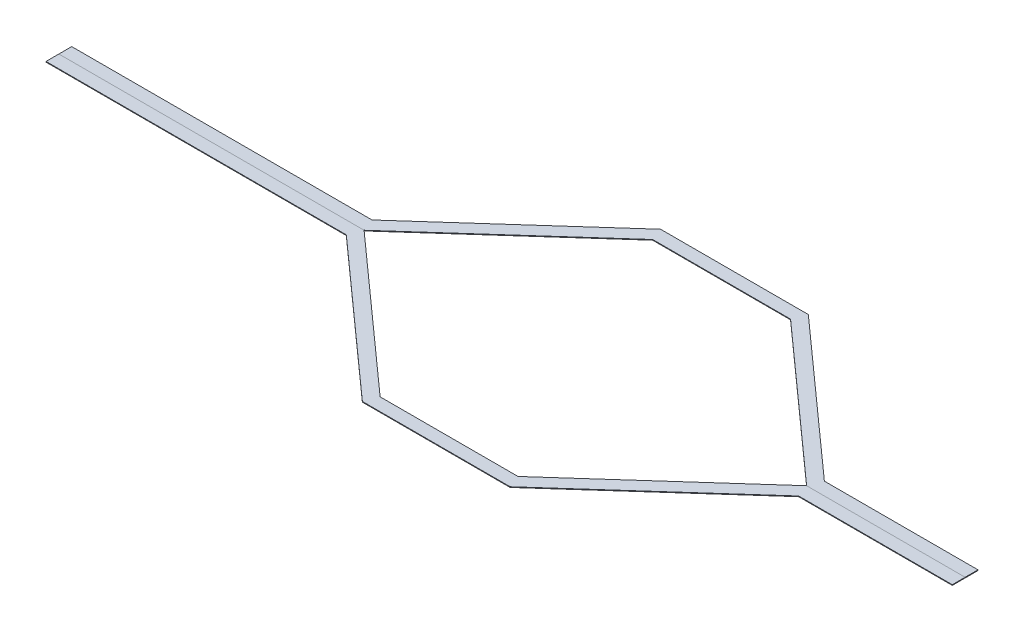
ISO-10303-21;
HEADER;
FILE_DESCRIPTION(('STEP AP214'),'2;1');
FILE_NAME('part.step','',(''),(''),'','','');
FILE_SCHEMA(('AUTOMOTIVE_DESIGN { 1 0 10303 214 1 1 1 1 }'));
ENDSEC;
DATA;
#1=APPLICATION_CONTEXT('core data for automotive mechanical design processes');
#2=APPLICATION_PROTOCOL_DEFINITION('international standard','automotive_design',2000,#1);
#3=PRODUCT_CONTEXT('',#1,'mechanical');
#4=PRODUCT('Part','Part','',(#3));
#5=PRODUCT_RELATED_PRODUCT_CATEGORY('part','',(#4));
#6=PRODUCT_DEFINITION_FORMATION('','',#4);
#7=PRODUCT_DEFINITION_CONTEXT('part definition',#1,'design');
#8=PRODUCT_DEFINITION('design','',#6,#7);
#9=PRODUCT_DEFINITION_SHAPE('','',#8);
#10=(LENGTH_UNIT() NAMED_UNIT(*) SI_UNIT(.MILLI.,.METRE.));
#11=(NAMED_UNIT(*) PLANE_ANGLE_UNIT() SI_UNIT($,.RADIAN.));
#12=(NAMED_UNIT(*) SI_UNIT($,.STERADIAN.) SOLID_ANGLE_UNIT());
#13=UNCERTAINTY_MEASURE_WITH_UNIT(LENGTH_MEASURE(1.E-05),#10,'distance_accuracy_value','');
#14=(GEOMETRIC_REPRESENTATION_CONTEXT(3) GLOBAL_UNCERTAINTY_ASSIGNED_CONTEXT((#13)) GLOBAL_UNIT_ASSIGNED_CONTEXT((#10,
#11,#12)) REPRESENTATION_CONTEXT('',''));
#15=CARTESIAN_POINT('',(0.,0.,0.));
#16=DIRECTION('',(0.,0.,1.));
#17=DIRECTION('',(1.,0.,0.));
#18=AXIS2_PLACEMENT_3D('',#15,#16,#17);
#19=CARTESIAN_POINT('',(0.,2.54,0.));
#20=DIRECTION('',(0.,1.,0.));
#21=DIRECTION('',(0.,0.,1.));
#22=AXIS2_PLACEMENT_3D('',#19,#20,#21);
#23=PLANE('',#22);
#24=DIRECTION('',(-1.,0.,0.));
#25=VECTOR('',#24,1.);
#26=CARTESIAN_POINT('',(0.,2.54,0.));
#27=LINE('',#26,#25);
#28=CARTESIAN_POINT('',(1748.8414211344,2.54,0.));
#29=VERTEX_POINT('',#28);
#30=CARTESIAN_POINT('',(2375.3067105672,2.54,0.));
#31=VERTEX_POINT('',#30);
#32=EDGE_CURVE('P0_E162',#29,#31,#27,.F.);
#33=ORIENTED_EDGE('',*,*,#32,.T.);
#34=DIRECTION('',(0.,0.,-1.));
#35=VECTOR('',#34,1.);
#36=CARTESIAN_POINT('',(2375.3067105672,2.54,0.));
#37=LINE('',#36,#35);
#38=CARTESIAN_POINT('',(2375.3067105672,2.54,-50.8));
#39=VERTEX_POINT('',#38);
#40=EDGE_CURVE('P0_E164',#39,#31,#37,.F.);
#41=ORIENTED_EDGE('',*,*,#40,.F.);
#42=DIRECTION('',(-1.,0.,0.));
#43=VECTOR('',#42,1.);
#44=CARTESIAN_POINT('',(0.,2.54,-50.8));
#45=LINE('',#44,#43);
#46=CARTESIAN_POINT('',(1768.2467105672,2.54,-50.8000000000003));
#47=VERTEX_POINT('',#46);
#48=EDGE_CURVE('P0_E119',#47,#39,#45,.F.);
#49=ORIENTED_EDGE('',*,*,#48,.F.);
#50=DIRECTION('',(-0.745323557128352,0.,-0.666702928739285));
#51=VECTOR('',#50,1.);
#52=CARTESIAN_POINT('',(811.215920403235,2.54,-906.878175167768));
#53=LINE('',#52,#51);
#54=CARTESIAN_POINT('',(1166.2667105672,2.54,-589.28));
#55=VERTEX_POINT('',#54);
#56=EDGE_CURVE('P0_E20',#55,#47,#53,.F.);
#57=ORIENTED_EDGE('',*,*,#56,.F.);
#58=DIRECTION('',(-1.,0.,0.));
#59=VECTOR('',#58,1.);
#60=CARTESIAN_POINT('',(0.,2.54,-589.28));
#61=LINE('',#60,#59);
#62=CARTESIAN_POINT('',(582.574710567202,2.54,-589.28));
#63=VERTEX_POINT('',#62);
#64=EDGE_CURVE('P0_E107',#63,#55,#61,.F.);
#65=ORIENTED_EDGE('',*,*,#64,.F.);
#66=DIRECTION('',(-0.745323557128352,0.,0.666702928739285));
#67=VECTOR('',#66,1.);
#68=CARTESIAN_POINT('',(-33.8685087799557,2.54,-37.8624367021203));
#69=LINE('',#68,#67);
#70=CARTESIAN_POINT('',(-19.4052894327977,2.54,-50.8));
#71=VERTEX_POINT('',#70);
#72=EDGE_CURVE('P0_E102',#71,#63,#69,.F.);
#73=ORIENTED_EDGE('',*,*,#72,.F.);
#74=DIRECTION('',(-1.,0.,0.));
#75=VECTOR('',#74,1.);
#76=CARTESIAN_POINT('',(0.,2.54,-50.8));
#77=LINE('',#76,#75);
#78=CARTESIAN_POINT('',(-1206.0932894328,2.54,-50.8));
#79=VERTEX_POINT('',#78);
#80=EDGE_CURVE('P0_E130',#79,#71,#77,.F.);
#81=ORIENTED_EDGE('',*,*,#80,.F.);
#82=DIRECTION('',(0.,0.,-1.));
#83=VECTOR('',#82,1.);
#84=CARTESIAN_POINT('',(-1206.0932894328,2.54,0.));
#85=LINE('',#84,#83);
#86=CARTESIAN_POINT('',(-1206.0932894328,2.54,0.));
#87=VERTEX_POINT('',#86);
#88=EDGE_CURVE('P0_E137',#79,#87,#85,.F.);
#89=ORIENTED_EDGE('',*,*,#88,.T.);
#90=DIRECTION('',(-1.,0.,0.));
#91=VECTOR('',#90,1.);
#92=CARTESIAN_POINT('',(0.,2.54,0.));
#93=LINE('',#92,#91);
#94=CARTESIAN_POINT('',(0.,2.54,0.));
#95=VERTEX_POINT('',#94);
#96=EDGE_CURVE('P0_E142',#87,#95,#93,.F.);
#97=ORIENTED_EDGE('',*,*,#96,.T.);
#98=DIRECTION('',(-0.745323557128352,0.,0.666702928739285));
#99=VECTOR('',#98,1.);
#100=CARTESIAN_POINT('',(0.,2.54,0.));
#101=LINE('',#100,#99);
#102=CARTESIAN_POINT('',(601.98,2.54,-538.48));
#103=VERTEX_POINT('',#102);
#104=EDGE_CURVE('P0_E147',#95,#103,#101,.F.);
#105=ORIENTED_EDGE('',*,*,#104,.T.);
#106=DIRECTION('',(-1.,0.,0.));
#107=VECTOR('',#106,1.);
#108=CARTESIAN_POINT('',(0.,2.54,-538.48));
#109=LINE('',#108,#107);
#110=CARTESIAN_POINT('',(1146.8614211344,2.54,-538.48));
#111=VERTEX_POINT('',#110);
#112=EDGE_CURVE('P0_E152',#103,#111,#109,.F.);
#113=ORIENTED_EDGE('',*,*,#112,.T.);
#114=DIRECTION('',(-0.745323557128352,0.,-0.666702928739285));
#115=VECTOR('',#114,1.);
#116=CARTESIAN_POINT('',(777.34741162328,2.54,-869.015738465647));
#117=LINE('',#116,#115);
#118=EDGE_CURVE('P0_E157',#111,#29,#117,.F.);
#119=ORIENTED_EDGE('',*,*,#118,.T.);
#120=EDGE_LOOP('',(#33,#41,#49,#57,#65,#73,#81,#89,#97,#105,#113,#119));
#121=FACE_BOUND('',#120,.T.);
#122=ADVANCED_FACE('P0_F17',(#121),#23,.T.);
#123=CARTESIAN_POINT('',(811.215920403235,2.54,-906.878175167768));
#124=DIRECTION('',(0.666702928739285,0.,-0.745323557128352));
#125=DIRECTION('',(-0.745323557128352,0.,-0.666702928739285));
#126=AXIS2_PLACEMENT_3D('',#123,#124,#125);
#127=PLANE('',#126);
#128=ORIENTED_EDGE('',*,*,#56,.T.);
#129=DIRECTION('',(0.,1.,0.));
#130=VECTOR('',#129,1.);
#131=CARTESIAN_POINT('',(1768.2467105672,2.54,-50.8));
#132=LINE('',#131,#130);
#133=CARTESIAN_POINT('',(1768.2467105672,0.,-50.8000000000003));
#134=VERTEX_POINT('',#133);
#135=EDGE_CURVE('P0_E168',#134,#47,#132,.T.);
#136=ORIENTED_EDGE('',*,*,#135,.F.);
#137=DIRECTION('',(-0.745323557128352,0.,-0.666702928739285));
#138=VECTOR('',#137,1.);
#139=CARTESIAN_POINT('',(1768.2467105672,0.,-50.8000000000004));
#140=LINE('',#139,#138);
#141=CARTESIAN_POINT('',(1166.2667105672,0.,-589.28));
#142=VERTEX_POINT('',#141);
#143=EDGE_CURVE('P0_E125',#134,#142,#140,.T.);
#144=ORIENTED_EDGE('',*,*,#143,.T.);
#145=DIRECTION('',(0.,1.,0.));
#146=VECTOR('',#145,1.);
#147=CARTESIAN_POINT('',(1166.2667105672,2.54,-589.28));
#148=LINE('',#147,#146);
#149=EDGE_CURVE('P0_E112',#55,#142,#148,.F.);
#150=ORIENTED_EDGE('',*,*,#149,.F.);
#151=EDGE_LOOP('',(#128,#136,#144,#150));
#152=FACE_BOUND('',#151,.T.);
#153=ADVANCED_FACE('P0_F124',(#152),#127,.T.);
#154=CARTESIAN_POINT('',(0.,2.54,-589.28));
#155=DIRECTION('',(0.,0.,-1.));
#156=DIRECTION('',(-1.,0.,0.));
#157=AXIS2_PLACEMENT_3D('',#154,#155,#156);
#158=PLANE('',#157);
#159=ORIENTED_EDGE('',*,*,#64,.T.);
#160=ORIENTED_EDGE('',*,*,#149,.T.);
#161=DIRECTION('',(1.,0.,0.));
#162=VECTOR('',#161,1.);
#163=CARTESIAN_POINT('',(0.,0.,-589.28));
#164=LINE('',#163,#162);
#165=CARTESIAN_POINT('',(582.574710567202,0.,-589.28));
#166=VERTEX_POINT('',#165);
#167=EDGE_CURVE('P0_E173',#142,#166,#164,.F.);
#168=ORIENTED_EDGE('',*,*,#167,.T.);
#169=DIRECTION('',(0.,1.,0.));
#170=VECTOR('',#169,1.);
#171=CARTESIAN_POINT('',(582.574710567202,2.54,-589.28));
#172=LINE('',#171,#170);
#173=EDGE_CURVE('P0_E114',#63,#166,#172,.F.);
#174=ORIENTED_EDGE('',*,*,#173,.F.);
#175=EDGE_LOOP('',(#159,#160,#168,#174));
#176=FACE_BOUND('',#175,.T.);
#177=ADVANCED_FACE('P0_F109',(#176),#158,.T.);
#178=CARTESIAN_POINT('',(-33.8685087799557,2.54,-37.8624367021203));
#179=DIRECTION('',(-0.666702928739285,0.,-0.745323557128352));
#180=DIRECTION('',(-0.745323557128352,0.,0.666702928739285));
#181=AXIS2_PLACEMENT_3D('',#178,#179,#180);
#182=PLANE('',#181);
#183=ORIENTED_EDGE('',*,*,#72,.T.);
#184=ORIENTED_EDGE('',*,*,#173,.T.);
#185=DIRECTION('',(-0.745323557128352,0.,0.666702928739285));
#186=VECTOR('',#185,1.);
#187=CARTESIAN_POINT('',(582.574710567202,0.,-589.28));
#188=LINE('',#187,#186);
#189=CARTESIAN_POINT('',(-19.4052894327978,0.,-50.8));
#190=VERTEX_POINT('',#189);
#191=EDGE_CURVE('P0_E175',#166,#190,#188,.T.);
#192=ORIENTED_EDGE('',*,*,#191,.T.);
#193=DIRECTION('',(0.,1.,0.));
#194=VECTOR('',#193,1.);
#195=CARTESIAN_POINT('',(-19.4052894327978,2.54,-50.8));
#196=LINE('',#195,#194);
#197=EDGE_CURVE('P0_E132',#71,#190,#196,.F.);
#198=ORIENTED_EDGE('',*,*,#197,.F.);
#199=EDGE_LOOP('',(#183,#184,#192,#198));
#200=FACE_BOUND('',#199,.T.);
#201=ADVANCED_FACE('P0_F234',(#200),#182,.T.);
#202=CARTESIAN_POINT('',(0.,2.54,-50.8));
#203=DIRECTION('',(0.,0.,-1.));
#204=DIRECTION('',(-1.,0.,0.));
#205=AXIS2_PLACEMENT_3D('',#202,#203,#204);
#206=PLANE('',#205);
#207=ORIENTED_EDGE('',*,*,#80,.T.);
#208=ORIENTED_EDGE('',*,*,#197,.T.);
#209=DIRECTION('',(1.,0.,0.));
#210=VECTOR('',#209,1.);
#211=CARTESIAN_POINT('',(0.,0.,-50.8));
#212=LINE('',#211,#210);
#213=CARTESIAN_POINT('',(-1206.0932894328,0.,-50.8));
#214=VERTEX_POINT('',#213);
#215=EDGE_CURVE('P0_E178',#190,#214,#212,.F.);
#216=ORIENTED_EDGE('',*,*,#215,.T.);
#217=DIRECTION('',(0.,1.,0.));
#218=VECTOR('',#217,1.);
#219=CARTESIAN_POINT('',(-1206.0932894328,2.54,-50.8));
#220=LINE('',#219,#218);
#221=EDGE_CURVE('P0_E134',#214,#79,#220,.T.);
#222=ORIENTED_EDGE('',*,*,#221,.T.);
#223=EDGE_LOOP('',(#207,#208,#216,#222));
#224=FACE_BOUND('',#223,.T.);
#225=ADVANCED_FACE('P0_F233',(#224),#206,.T.);
#226=CARTESIAN_POINT('',(-1206.0932894328,2.54,0.));
#227=DIRECTION('',(1.,0.,0.));
#228=DIRECTION('',(0.,0.,-1.));
#229=AXIS2_PLACEMENT_3D('',#226,#227,#228);
#230=PLANE('',#229);
#231=DIRECTION('',(0.,1.,0.));
#232=VECTOR('',#231,1.);
#233=CARTESIAN_POINT('',(-1206.0932894328,2.54,0.));
#234=LINE('',#233,#232);
#235=CARTESIAN_POINT('',(-1206.0932894328,0.,0.));
#236=VERTEX_POINT('',#235);
#237=EDGE_CURVE('P0_E139',#236,#87,#234,.T.);
#238=ORIENTED_EDGE('',*,*,#237,.T.);
#239=ORIENTED_EDGE('',*,*,#88,.F.);
#240=ORIENTED_EDGE('',*,*,#221,.F.);
#241=DIRECTION('',(0.,0.,1.));
#242=VECTOR('',#241,1.);
#243=CARTESIAN_POINT('',(-1206.0932894328,0.,0.));
#244=LINE('',#243,#242);
#245=EDGE_CURVE('P0_E181',#214,#236,#244,.T.);
#246=ORIENTED_EDGE('',*,*,#245,.T.);
#247=EDGE_LOOP('',(#238,#239,#240,#246));
#248=FACE_BOUND('',#247,.T.);
#249=ADVANCED_FACE('P0_F229',(#248),#230,.F.);
#250=CARTESIAN_POINT('',(0.,2.54,0.));
#251=DIRECTION('',(0.,0.,-1.));
#252=DIRECTION('',(-1.,0.,0.));
#253=AXIS2_PLACEMENT_3D('',#250,#251,#252);
#254=PLANE('',#253);
#255=DIRECTION('',(0.,1.,0.));
#256=VECTOR('',#255,1.);
#257=CARTESIAN_POINT('',(0.,2.54,0.));
#258=LINE('',#257,#256);
#259=CARTESIAN_POINT('',(0.,0.,0.));
#260=VERTEX_POINT('',#259);
#261=EDGE_CURVE('P0_E144',#260,#95,#258,.T.);
#262=ORIENTED_EDGE('',*,*,#261,.T.);
#263=ORIENTED_EDGE('',*,*,#96,.F.);
#264=ORIENTED_EDGE('',*,*,#237,.F.);
#265=DIRECTION('',(1.,0.,0.));
#266=VECTOR('',#265,1.);
#267=CARTESIAN_POINT('',(0.,0.,0.));
#268=LINE('',#267,#266);
#269=EDGE_CURVE('P0_E184',#236,#260,#268,.T.);
#270=ORIENTED_EDGE('',*,*,#269,.T.);
#271=EDGE_LOOP('',(#262,#263,#264,#270));
#272=FACE_BOUND('',#271,.T.);
#273=ADVANCED_FACE('P0_F225',(#272),#254,.F.);
#274=CARTESIAN_POINT('',(0.,2.54,0.));
#275=DIRECTION('',(-0.666702928739285,0.,-0.745323557128352));
#276=DIRECTION('',(-0.745323557128352,0.,0.666702928739285));
#277=AXIS2_PLACEMENT_3D('',#274,#275,#276);
#278=PLANE('',#277);
#279=DIRECTION('',(0.,1.,0.));
#280=VECTOR('',#279,1.);
#281=CARTESIAN_POINT('',(601.98,2.54,-538.48));
#282=LINE('',#281,#280);
#283=CARTESIAN_POINT('',(601.98,0.,-538.48));
#284=VERTEX_POINT('',#283);
#285=EDGE_CURVE('P0_E149',#284,#103,#282,.T.);
#286=ORIENTED_EDGE('',*,*,#285,.T.);
#287=ORIENTED_EDGE('',*,*,#104,.F.);
#288=ORIENTED_EDGE('',*,*,#261,.F.);
#289=DIRECTION('',(0.745323557128352,0.,-0.666702928739285));
#290=VECTOR('',#289,1.);
#291=CARTESIAN_POINT('',(0.,0.,0.));
#292=LINE('',#291,#290);
#293=EDGE_CURVE('P0_E187',#260,#284,#292,.T.);
#294=ORIENTED_EDGE('',*,*,#293,.T.);
#295=EDGE_LOOP('',(#286,#287,#288,#294));
#296=FACE_BOUND('',#295,.T.);
#297=ADVANCED_FACE('P0_F221',(#296),#278,.F.);
#298=CARTESIAN_POINT('',(0.,2.54,-538.48));
#299=DIRECTION('',(0.,0.,-1.));
#300=DIRECTION('',(-1.,0.,0.));
#301=AXIS2_PLACEMENT_3D('',#298,#299,#300);
#302=PLANE('',#301);
#303=DIRECTION('',(0.,1.,0.));
#304=VECTOR('',#303,1.);
#305=CARTESIAN_POINT('',(1146.8614211344,2.54,-538.48));
#306=LINE('',#305,#304);
#307=CARTESIAN_POINT('',(1146.8614211344,0.,-538.48));
#308=VERTEX_POINT('',#307);
#309=EDGE_CURVE('P0_E154',#308,#111,#306,.T.);
#310=ORIENTED_EDGE('',*,*,#309,.T.);
#311=ORIENTED_EDGE('',*,*,#112,.F.);
#312=ORIENTED_EDGE('',*,*,#285,.F.);
#313=DIRECTION('',(1.,0.,0.));
#314=VECTOR('',#313,1.);
#315=CARTESIAN_POINT('',(0.,0.,-538.48));
#316=LINE('',#315,#314);
#317=EDGE_CURVE('P0_E190',#284,#308,#316,.T.);
#318=ORIENTED_EDGE('',*,*,#317,.T.);
#319=EDGE_LOOP('',(#310,#311,#312,#318));
#320=FACE_BOUND('',#319,.T.);
#321=ADVANCED_FACE('P0_F217',(#320),#302,.F.);
#322=CARTESIAN_POINT('',(777.34741162328,2.54,-869.015738465647));
#323=DIRECTION('',(0.666702928739285,0.,-0.745323557128352));
#324=DIRECTION('',(-0.745323557128352,0.,-0.666702928739285));
#325=AXIS2_PLACEMENT_3D('',#322,#323,#324);
#326=PLANE('',#325);
#327=DIRECTION('',(0.,1.,0.));
#328=VECTOR('',#327,1.);
#329=CARTESIAN_POINT('',(1748.8414211344,2.54,0.));
#330=LINE('',#329,#328);
#331=CARTESIAN_POINT('',(1748.8414211344,0.,1.94289029309402E-13));
#332=VERTEX_POINT('',#331);
#333=EDGE_CURVE('P0_E159',#332,#29,#330,.T.);
#334=ORIENTED_EDGE('',*,*,#333,.T.);
#335=ORIENTED_EDGE('',*,*,#118,.F.);
#336=ORIENTED_EDGE('',*,*,#309,.F.);
#337=DIRECTION('',(0.745323557128352,0.,0.666702928739285));
#338=VECTOR('',#337,1.);
#339=CARTESIAN_POINT('',(1146.8614211344,0.,-538.48));
#340=LINE('',#339,#338);
#341=EDGE_CURVE('P0_E193',#308,#332,#340,.T.);
#342=ORIENTED_EDGE('',*,*,#341,.T.);
#343=EDGE_LOOP('',(#334,#335,#336,#342));
#344=FACE_BOUND('',#343,.T.);
#345=ADVANCED_FACE('P0_F213',(#344),#326,.F.);
#346=CARTESIAN_POINT('',(0.,2.54,0.));
#347=DIRECTION('',(0.,0.,-1.));
#348=DIRECTION('',(-1.,0.,0.));
#349=AXIS2_PLACEMENT_3D('',#346,#347,#348);
#350=PLANE('',#349);
#351=DIRECTION('',(0.,1.,0.));
#352=VECTOR('',#351,1.);
#353=CARTESIAN_POINT('',(2375.3067105672,2.54,0.));
#354=LINE('',#353,#352);
#355=CARTESIAN_POINT('',(2375.3067105672,0.,0.));
#356=VERTEX_POINT('',#355);
#357=EDGE_CURVE('P0_E166',#31,#356,#354,.F.);
#358=ORIENTED_EDGE('',*,*,#357,.F.);
#359=ORIENTED_EDGE('',*,*,#32,.F.);
#360=ORIENTED_EDGE('',*,*,#333,.F.);
#361=DIRECTION('',(1.,0.,0.));
#362=VECTOR('',#361,1.);
#363=CARTESIAN_POINT('',(0.,0.,0.));
#364=LINE('',#363,#362);
#365=EDGE_CURVE('P0_E196',#332,#356,#364,.T.);
#366=ORIENTED_EDGE('',*,*,#365,.T.);
#367=EDGE_LOOP('',(#358,#359,#360,#366));
#368=FACE_BOUND('',#367,.T.);
#369=ADVANCED_FACE('P0_F209',(#368),#350,.F.);
#370=CARTESIAN_POINT('',(2375.3067105672,2.54,0.));
#371=DIRECTION('',(1.,0.,0.));
#372=DIRECTION('',(0.,0.,-1.));
#373=AXIS2_PLACEMENT_3D('',#370,#371,#372);
#374=PLANE('',#373);
#375=ORIENTED_EDGE('',*,*,#40,.T.);
#376=ORIENTED_EDGE('',*,*,#357,.T.);
#377=DIRECTION('',(0.,0.,1.));
#378=VECTOR('',#377,1.);
#379=CARTESIAN_POINT('',(2375.3067105672,0.,0.));
#380=LINE('',#379,#378);
#381=CARTESIAN_POINT('',(2375.3067105672,0.,-50.8));
#382=VERTEX_POINT('',#381);
#383=EDGE_CURVE('P0_E26',#356,#382,#380,.F.);
#384=ORIENTED_EDGE('',*,*,#383,.T.);
#385=DIRECTION('',(0.,1.,0.));
#386=VECTOR('',#385,1.);
#387=CARTESIAN_POINT('',(2375.3067105672,2.54,-50.8));
#388=LINE('',#387,#386);
#389=EDGE_CURVE('P0_E34',#39,#382,#388,.F.);
#390=ORIENTED_EDGE('',*,*,#389,.F.);
#391=EDGE_LOOP('',(#375,#376,#384,#390));
#392=FACE_BOUND('',#391,.T.);
#393=ADVANCED_FACE('P0_F202',(#392),#374,.T.);
#394=CARTESIAN_POINT('',(0.,2.54,-50.8));
#395=DIRECTION('',(0.,0.,-1.));
#396=DIRECTION('',(-1.,0.,0.));
#397=AXIS2_PLACEMENT_3D('',#394,#395,#396);
#398=PLANE('',#397);
#399=ORIENTED_EDGE('',*,*,#48,.T.);
#400=ORIENTED_EDGE('',*,*,#389,.T.);
#401=DIRECTION('',(1.,0.,0.));
#402=VECTOR('',#401,1.);
#403=CARTESIAN_POINT('',(0.,0.,-50.8));
#404=LINE('',#403,#402);
#405=EDGE_CURVE('P0_E11',#382,#134,#404,.F.);
#406=ORIENTED_EDGE('',*,*,#405,.T.);
#407=ORIENTED_EDGE('',*,*,#135,.T.);
#408=EDGE_LOOP('',(#399,#400,#406,#407));
#409=FACE_BOUND('',#408,.T.);
#410=ADVANCED_FACE('P0_F235',(#409),#398,.T.);
#411=CARTESIAN_POINT('',(0.,0.,0.));
#412=DIRECTION('',(0.,1.,0.));
#413=DIRECTION('',(0.,0.,1.));
#414=AXIS2_PLACEMENT_3D('',#411,#412,#413);
#415=PLANE('',#414);
#416=ORIENTED_EDGE('',*,*,#383,.F.);
#417=ORIENTED_EDGE('',*,*,#365,.F.);
#418=ORIENTED_EDGE('',*,*,#341,.F.);
#419=ORIENTED_EDGE('',*,*,#317,.F.);
#420=ORIENTED_EDGE('',*,*,#293,.F.);
#421=ORIENTED_EDGE('',*,*,#269,.F.);
#422=ORIENTED_EDGE('',*,*,#245,.F.);
#423=ORIENTED_EDGE('',*,*,#215,.F.);
#424=ORIENTED_EDGE('',*,*,#191,.F.);
#425=ORIENTED_EDGE('',*,*,#167,.F.);
#426=ORIENTED_EDGE('',*,*,#143,.F.);
#427=ORIENTED_EDGE('',*,*,#405,.F.);
#428=EDGE_LOOP('',(#416,#417,#418,#419,#420,#421,#422,#423,#424,#425,#426,#427));
#429=FACE_BOUND('',#428,.T.);
#430=ADVANCED_FACE('P0_F206',(#429),#415,.F.);
#431=CLOSED_SHELL('',(#122,#153,#177,#201,#225,#249,#273,#297,#321,#345,#369,#393,#410,#430));
#432=MANIFOLD_SOLID_BREP('P0_B1',#431);
#433=CARTESIAN_POINT('',(0.,2.54,0.));
#434=DIRECTION('',(0.,1.,0.));
#435=DIRECTION('',(0.,0.,1.));
#436=AXIS2_PLACEMENT_3D('',#433,#434,#435);
#437=PLANE('',#436);
#438=DIRECTION('',(-1.,0.,0.));
#439=VECTOR('',#438,1.);
#440=CARTESIAN_POINT('',(0.,2.54,0.));
#441=LINE('',#440,#439);
#442=CARTESIAN_POINT('',(-1206.0932894328,2.54,0.));
#443=VERTEX_POINT('',#442);
#444=CARTESIAN_POINT('',(0.,2.54,0.));
#445=VERTEX_POINT('',#444);
#446=EDGE_CURVE('P1_E157',#443,#445,#441,.F.);
#447=ORIENTED_EDGE('',*,*,#446,.F.);
#448=DIRECTION('',(0.,0.,-1.));
#449=VECTOR('',#448,1.);
#450=CARTESIAN_POINT('',(-1206.0932894328,2.54,0.));
#451=LINE('',#450,#449);
#452=CARTESIAN_POINT('',(-1206.0932894328,2.54,50.8));
#453=VERTEX_POINT('',#452);
#454=EDGE_CURVE('P1_E164',#443,#453,#451,.F.);
#455=ORIENTED_EDGE('',*,*,#454,.T.);
#456=DIRECTION('',(1.,0.,0.));
#457=VECTOR('',#456,1.);
#458=CARTESIAN_POINT('',(0.,2.54,50.7999999999999));
#459=LINE('',#458,#457);
#460=CARTESIAN_POINT('',(-19.4052894327977,2.54,50.7999999999999));
#461=VERTEX_POINT('',#460);
#462=EDGE_CURVE('P1_E118',#461,#453,#459,.F.);
#463=ORIENTED_EDGE('',*,*,#462,.F.);
#464=DIRECTION('',(0.745323557128352,0.,0.666702928739285));
#465=VECTOR('',#464,1.);
#466=CARTESIAN_POINT('',(-33.8685087799556,2.54,37.8624367021202));
#467=LINE('',#466,#465);
#468=CARTESIAN_POINT('',(582.574710567202,2.54,589.28));
#469=VERTEX_POINT('',#468);
#470=EDGE_CURVE('P1_E20',#469,#461,#467,.F.);
#471=ORIENTED_EDGE('',*,*,#470,.F.);
#472=DIRECTION('',(1.,0.,0.));
#473=VECTOR('',#472,1.);
#474=CARTESIAN_POINT('',(1.12085179161461E-13,2.54,589.28));
#475=LINE('',#474,#473);
#476=CARTESIAN_POINT('',(1166.2667105672,2.54,589.28));
#477=VERTEX_POINT('',#476);
#478=EDGE_CURVE('P1_E107',#477,#469,#475,.F.);
#479=ORIENTED_EDGE('',*,*,#478,.F.);
#480=DIRECTION('',(0.745323557128352,0.,-0.666702928739285));
#481=VECTOR('',#480,1.);
#482=CARTESIAN_POINT('',(811.215920403235,2.54,906.878175167768));
#483=LINE('',#482,#481);
#484=CARTESIAN_POINT('',(1768.2467105672,2.54,50.8000000000001));
#485=VERTEX_POINT('',#484);
#486=EDGE_CURVE('P1_E102',#485,#477,#483,.F.);
#487=ORIENTED_EDGE('',*,*,#486,.F.);
#488=DIRECTION('',(1.,0.,0.));
#489=VECTOR('',#488,1.);
#490=CARTESIAN_POINT('',(0.,2.54,50.8000000000003));
#491=LINE('',#490,#489);
#492=CARTESIAN_POINT('',(2375.3067105672,2.54,50.8));
#493=VERTEX_POINT('',#492);
#494=EDGE_CURVE('P1_E129',#493,#485,#491,.F.);
#495=ORIENTED_EDGE('',*,*,#494,.F.);
#496=DIRECTION('',(0.,0.,-1.));
#497=VECTOR('',#496,1.);
#498=CARTESIAN_POINT('',(2375.3067105672,2.54,0.));
#499=LINE('',#498,#497);
#500=CARTESIAN_POINT('',(2375.3067105672,2.54,0.));
#501=VERTEX_POINT('',#500);
#502=EDGE_CURVE('P1_E133',#501,#493,#499,.F.);
#503=ORIENTED_EDGE('',*,*,#502,.F.);
#504=DIRECTION('',(-1.,0.,0.));
#505=VECTOR('',#504,1.);
#506=CARTESIAN_POINT('',(0.,2.54,0.));
#507=LINE('',#506,#505);
#508=CARTESIAN_POINT('',(1748.8414211344,2.54,-1.10593395329907E-13));
#509=VERTEX_POINT('',#508);
#510=EDGE_CURVE('P1_E137',#509,#501,#507,.F.);
#511=ORIENTED_EDGE('',*,*,#510,.F.);
#512=DIRECTION('',(0.745323557128352,0.,-0.666702928739286));
#513=VECTOR('',#512,1.);
#514=CARTESIAN_POINT('',(777.34741162328,2.54,869.015738465648));
#515=LINE('',#514,#513);
#516=CARTESIAN_POINT('',(1146.8614211344,2.54,538.48));
#517=VERTEX_POINT('',#516);
#518=EDGE_CURVE('P1_E144',#509,#517,#515,.F.);
#519=ORIENTED_EDGE('',*,*,#518,.T.);
#520=DIRECTION('',(1.,0.,0.));
#521=VECTOR('',#520,1.);
#522=CARTESIAN_POINT('',(1.09717981034389E-13,2.54,538.48));
#523=LINE('',#522,#521);
#524=CARTESIAN_POINT('',(601.98,2.54,538.48));
#525=VERTEX_POINT('',#524);
#526=EDGE_CURVE('P1_E149',#517,#525,#523,.F.);
#527=ORIENTED_EDGE('',*,*,#526,.T.);
#528=DIRECTION('',(0.745323557128352,0.,0.666702928739285));
#529=VECTOR('',#528,1.);
#530=CARTESIAN_POINT('',(0.,2.54,0.));
#531=LINE('',#530,#529);
#532=EDGE_CURVE('P1_E154',#525,#445,#531,.F.);
#533=ORIENTED_EDGE('',*,*,#532,.T.);
#534=EDGE_LOOP('',(#447,#455,#463,#471,#479,#487,#495,#503,#511,#519,#527,#533));
#535=FACE_BOUND('',#534,.T.);
#536=ADVANCED_FACE('P1_F17',(#535),#437,.T.);
#537=CARTESIAN_POINT('',(-33.8685087799556,2.54,37.8624367021202));
#538=DIRECTION('',(-0.666702928739285,0.,0.745323557128352));
#539=DIRECTION('',(0.745323557128352,0.,0.666702928739285));
#540=AXIS2_PLACEMENT_3D('',#537,#538,#539);
#541=PLANE('',#540);
#542=ORIENTED_EDGE('',*,*,#470,.T.);
#543=DIRECTION('',(0.,1.,0.));
#544=VECTOR('',#543,1.);
#545=CARTESIAN_POINT('',(-19.4052894327978,2.54,50.7999999999999));
#546=LINE('',#545,#544);
#547=CARTESIAN_POINT('',(-19.4052894327977,0.,50.7999999999999));
#548=VERTEX_POINT('',#547);
#549=EDGE_CURVE('P1_E166',#548,#461,#546,.T.);
#550=ORIENTED_EDGE('',*,*,#549,.F.);
#551=DIRECTION('',(0.745323557128352,0.,0.666702928739285));
#552=VECTOR('',#551,1.);
#553=CARTESIAN_POINT('',(-19.4052894327978,0.,50.7999999999998));
#554=LINE('',#553,#552);
#555=CARTESIAN_POINT('',(582.574710567202,0.,589.28));
#556=VERTEX_POINT('',#555);
#557=EDGE_CURVE('P1_E124',#548,#556,#554,.T.);
#558=ORIENTED_EDGE('',*,*,#557,.T.);
#559=DIRECTION('',(0.,1.,0.));
#560=VECTOR('',#559,1.);
#561=CARTESIAN_POINT('',(582.574710567202,2.54,589.28));
#562=LINE('',#561,#560);
#563=EDGE_CURVE('P1_E112',#469,#556,#562,.F.);
#564=ORIENTED_EDGE('',*,*,#563,.F.);
#565=EDGE_LOOP('',(#542,#550,#558,#564));
#566=FACE_BOUND('',#565,.T.);
#567=ADVANCED_FACE('P1_F123',(#566),#541,.T.);
#568=CARTESIAN_POINT('',(1.12085179161461E-13,2.54,589.28));
#569=DIRECTION('',(0.,0.,1.));
#570=DIRECTION('',(1.,0.,0.));
#571=AXIS2_PLACEMENT_3D('',#568,#569,#570);
#572=PLANE('',#571);
#573=ORIENTED_EDGE('',*,*,#478,.T.);
#574=ORIENTED_EDGE('',*,*,#563,.T.);
#575=DIRECTION('',(1.,0.,0.));
#576=VECTOR('',#575,1.);
#577=CARTESIAN_POINT('',(0.,0.,589.28));
#578=LINE('',#577,#576);
#579=CARTESIAN_POINT('',(1166.2667105672,0.,589.28));
#580=VERTEX_POINT('',#579);
#581=EDGE_CURVE('P1_E171',#556,#580,#578,.T.);
#582=ORIENTED_EDGE('',*,*,#581,.T.);
#583=DIRECTION('',(0.,1.,0.));
#584=VECTOR('',#583,1.);
#585=CARTESIAN_POINT('',(1166.2667105672,2.54,589.28));
#586=LINE('',#585,#584);
#587=EDGE_CURVE('P1_E114',#477,#580,#586,.F.);
#588=ORIENTED_EDGE('',*,*,#587,.F.);
#589=EDGE_LOOP('',(#573,#574,#582,#588));
#590=FACE_BOUND('',#589,.T.);
#591=ADVANCED_FACE('P1_F109',(#590),#572,.T.);
#592=CARTESIAN_POINT('',(811.215920403235,2.54,906.878175167768));
#593=DIRECTION('',(0.666702928739285,0.,0.745323557128352));
#594=DIRECTION('',(0.745323557128352,0.,-0.666702928739285));
#595=AXIS2_PLACEMENT_3D('',#592,#593,#594);
#596=PLANE('',#595);
#597=ORIENTED_EDGE('',*,*,#486,.T.);
#598=ORIENTED_EDGE('',*,*,#587,.T.);
#599=DIRECTION('',(0.745323557128352,0.,-0.666702928739285));
#600=VECTOR('',#599,1.);
#601=CARTESIAN_POINT('',(1166.2667105672,0.,589.28));
#602=LINE('',#601,#600);
#603=CARTESIAN_POINT('',(1768.2467105672,0.,50.8000000000001));
#604=VERTEX_POINT('',#603);
#605=EDGE_CURVE('P1_E173',#580,#604,#602,.T.);
#606=ORIENTED_EDGE('',*,*,#605,.T.);
#607=DIRECTION('',(0.,1.,0.));
#608=VECTOR('',#607,1.);
#609=CARTESIAN_POINT('',(1768.2467105672,2.54,50.8000000000001));
#610=LINE('',#609,#608);
#611=EDGE_CURVE('P1_E131',#485,#604,#610,.F.);
#612=ORIENTED_EDGE('',*,*,#611,.F.);
#613=EDGE_LOOP('',(#597,#598,#606,#612));
#614=FACE_BOUND('',#613,.T.);
#615=ADVANCED_FACE('P1_F234',(#614),#596,.T.);
#616=CARTESIAN_POINT('',(0.,2.54,50.8000000000003));
#617=DIRECTION('',(0.,0.,1.));
#618=DIRECTION('',(1.,0.,0.));
#619=AXIS2_PLACEMENT_3D('',#616,#617,#618);
#620=PLANE('',#619);
#621=ORIENTED_EDGE('',*,*,#494,.T.);
#622=ORIENTED_EDGE('',*,*,#611,.T.);
#623=DIRECTION('',(1.,0.,0.));
#624=VECTOR('',#623,1.);
#625=CARTESIAN_POINT('',(0.,0.,50.8000000000001));
#626=LINE('',#625,#624);
#627=CARTESIAN_POINT('',(2375.3067105672,0.,50.8));
#628=VERTEX_POINT('',#627);
#629=EDGE_CURVE('P1_E176',#604,#628,#626,.T.);
#630=ORIENTED_EDGE('',*,*,#629,.T.);
#631=DIRECTION('',(0.,1.,0.));
#632=VECTOR('',#631,1.);
#633=CARTESIAN_POINT('',(2375.3067105672,2.54,50.8));
#634=LINE('',#633,#632);
#635=EDGE_CURVE('P1_E135',#493,#628,#634,.F.);
#636=ORIENTED_EDGE('',*,*,#635,.F.);
#637=EDGE_LOOP('',(#621,#622,#630,#636));
#638=FACE_BOUND('',#637,.T.);
#639=ADVANCED_FACE('P1_F233',(#638),#620,.T.);
#640=CARTESIAN_POINT('',(2375.3067105672,2.54,0.));
#641=DIRECTION('',(1.,0.,0.));
#642=DIRECTION('',(0.,0.,-1.));
#643=AXIS2_PLACEMENT_3D('',#640,#641,#642);
#644=PLANE('',#643);
#645=ORIENTED_EDGE('',*,*,#502,.T.);
#646=ORIENTED_EDGE('',*,*,#635,.T.);
#647=DIRECTION('',(0.,0.,1.));
#648=VECTOR('',#647,1.);
#649=CARTESIAN_POINT('',(2375.3067105672,0.,0.));
#650=LINE('',#649,#648);
#651=CARTESIAN_POINT('',(2375.3067105672,0.,0.));
#652=VERTEX_POINT('',#651);
#653=EDGE_CURVE('P1_E179',#628,#652,#650,.F.);
#654=ORIENTED_EDGE('',*,*,#653,.T.);
#655=DIRECTION('',(0.,1.,0.));
#656=VECTOR('',#655,1.);
#657=CARTESIAN_POINT('',(2375.3067105672,2.54,0.));
#658=LINE('',#657,#656);
#659=EDGE_CURVE('P1_E139',#501,#652,#658,.F.);
#660=ORIENTED_EDGE('',*,*,#659,.F.);
#661=EDGE_LOOP('',(#645,#646,#654,#660));
#662=FACE_BOUND('',#661,.T.);
#663=ADVANCED_FACE('P1_F227',(#662),#644,.T.);
#664=CARTESIAN_POINT('',(0.,2.54,0.));
#665=DIRECTION('',(0.,0.,-1.));
#666=DIRECTION('',(-1.,0.,0.));
#667=AXIS2_PLACEMENT_3D('',#664,#665,#666);
#668=PLANE('',#667);
#669=ORIENTED_EDGE('',*,*,#510,.T.);
#670=ORIENTED_EDGE('',*,*,#659,.T.);
#671=DIRECTION('',(1.,0.,0.));
#672=VECTOR('',#671,1.);
#673=CARTESIAN_POINT('',(0.,0.,0.));
#674=LINE('',#673,#672);
#675=CARTESIAN_POINT('',(1748.8414211344,0.,-1.10593395329907E-13));
#676=VERTEX_POINT('',#675);
#677=EDGE_CURVE('P1_E182',#652,#676,#674,.F.);
#678=ORIENTED_EDGE('',*,*,#677,.T.);
#679=DIRECTION('',(0.,1.,0.));
#680=VECTOR('',#679,1.);
#681=CARTESIAN_POINT('',(1748.8414211344,2.54,-1.11022302462516E-13));
#682=LINE('',#681,#680);
#683=EDGE_CURVE('P1_E141',#676,#509,#682,.T.);
#684=ORIENTED_EDGE('',*,*,#683,.T.);
#685=EDGE_LOOP('',(#669,#670,#678,#684));
#686=FACE_BOUND('',#685,.T.);
#687=ADVANCED_FACE('P1_F223',(#686),#668,.T.);
#688=CARTESIAN_POINT('',(777.34741162328,2.54,869.015738465648));
#689=DIRECTION('',(0.666702928739286,0.,0.745323557128352));
#690=DIRECTION('',(0.745323557128352,0.,-0.666702928739286));
#691=AXIS2_PLACEMENT_3D('',#688,#689,#690);
#692=PLANE('',#691);
#693=DIRECTION('',(0.,1.,0.));
#694=VECTOR('',#693,1.);
#695=CARTESIAN_POINT('',(1146.8614211344,2.54,538.48));
#696=LINE('',#695,#694);
#697=CARTESIAN_POINT('',(1146.8614211344,0.,538.48));
#698=VERTEX_POINT('',#697);
#699=EDGE_CURVE('P1_E146',#698,#517,#696,.T.);
#700=ORIENTED_EDGE('',*,*,#699,.T.);
#701=ORIENTED_EDGE('',*,*,#518,.F.);
#702=ORIENTED_EDGE('',*,*,#683,.F.);
#703=DIRECTION('',(-0.745323557128352,0.,0.666702928739285));
#704=VECTOR('',#703,1.);
#705=CARTESIAN_POINT('',(1748.8414211344,0.,0.));
#706=LINE('',#705,#704);
#707=EDGE_CURVE('P1_E185',#676,#698,#706,.T.);
#708=ORIENTED_EDGE('',*,*,#707,.T.);
#709=EDGE_LOOP('',(#700,#701,#702,#708));
#710=FACE_BOUND('',#709,.T.);
#711=ADVANCED_FACE('P1_F219',(#710),#692,.F.);
#712=CARTESIAN_POINT('',(1.09717981034389E-13,2.54,538.48));
#713=DIRECTION('',(0.,0.,1.));
#714=DIRECTION('',(1.,0.,0.));
#715=AXIS2_PLACEMENT_3D('',#712,#713,#714);
#716=PLANE('',#715);
#717=DIRECTION('',(0.,1.,0.));
#718=VECTOR('',#717,1.);
#719=CARTESIAN_POINT('',(601.98,2.54,538.48));
#720=LINE('',#719,#718);
#721=CARTESIAN_POINT('',(601.98,0.,538.48));
#722=VERTEX_POINT('',#721);
#723=EDGE_CURVE('P1_E151',#722,#525,#720,.T.);
#724=ORIENTED_EDGE('',*,*,#723,.T.);
#725=ORIENTED_EDGE('',*,*,#526,.F.);
#726=ORIENTED_EDGE('',*,*,#699,.F.);
#727=DIRECTION('',(1.,0.,0.));
#728=VECTOR('',#727,1.);
#729=CARTESIAN_POINT('',(0.,0.,538.48));
#730=LINE('',#729,#728);
#731=EDGE_CURVE('P1_E188',#698,#722,#730,.F.);
#732=ORIENTED_EDGE('',*,*,#731,.T.);
#733=EDGE_LOOP('',(#724,#725,#726,#732));
#734=FACE_BOUND('',#733,.T.);
#735=ADVANCED_FACE('P1_F215',(#734),#716,.F.);
#736=CARTESIAN_POINT('',(0.,2.54,0.));
#737=DIRECTION('',(-0.666702928739285,0.,0.745323557128352));
#738=DIRECTION('',(0.745323557128352,0.,0.666702928739285));
#739=AXIS2_PLACEMENT_3D('',#736,#737,#738);
#740=PLANE('',#739);
#741=DIRECTION('',(0.,1.,0.));
#742=VECTOR('',#741,1.);
#743=CARTESIAN_POINT('',(0.,2.54,0.));
#744=LINE('',#743,#742);
#745=CARTESIAN_POINT('',(0.,0.,0.));
#746=VERTEX_POINT('',#745);
#747=EDGE_CURVE('P1_E159',#445,#746,#744,.F.);
#748=ORIENTED_EDGE('',*,*,#747,.F.);
#749=ORIENTED_EDGE('',*,*,#532,.F.);
#750=ORIENTED_EDGE('',*,*,#723,.F.);
#751=DIRECTION('',(-0.745323557128352,0.,-0.666702928739285));
#752=VECTOR('',#751,1.);
#753=CARTESIAN_POINT('',(601.98,0.,538.48));
#754=LINE('',#753,#752);
#755=EDGE_CURVE('P1_E191',#722,#746,#754,.T.);
#756=ORIENTED_EDGE('',*,*,#755,.T.);
#757=EDGE_LOOP('',(#748,#749,#750,#756));
#758=FACE_BOUND('',#757,.T.);
#759=ADVANCED_FACE('P1_F211',(#758),#740,.F.);
#760=CARTESIAN_POINT('',(0.,2.54,0.));
#761=DIRECTION('',(0.,0.,-1.));
#762=DIRECTION('',(-1.,0.,0.));
#763=AXIS2_PLACEMENT_3D('',#760,#761,#762);
#764=PLANE('',#763);
#765=ORIENTED_EDGE('',*,*,#446,.T.);
#766=ORIENTED_EDGE('',*,*,#747,.T.);
#767=DIRECTION('',(1.,0.,0.));
#768=VECTOR('',#767,1.);
#769=CARTESIAN_POINT('',(0.,0.,0.));
#770=LINE('',#769,#768);
#771=CARTESIAN_POINT('',(-1206.0932894328,0.,0.));
#772=VERTEX_POINT('',#771);
#773=EDGE_CURVE('P1_E194',#746,#772,#770,.F.);
#774=ORIENTED_EDGE('',*,*,#773,.T.);
#775=DIRECTION('',(0.,1.,0.));
#776=VECTOR('',#775,1.);
#777=CARTESIAN_POINT('',(-1206.0932894328,2.54,0.));
#778=LINE('',#777,#776);
#779=EDGE_CURVE('P1_E161',#772,#443,#778,.T.);
#780=ORIENTED_EDGE('',*,*,#779,.T.);
#781=EDGE_LOOP('',(#765,#766,#774,#780));
#782=FACE_BOUND('',#781,.T.);
#783=ADVANCED_FACE('P1_F207',(#782),#764,.T.);
#784=CARTESIAN_POINT('',(-1206.0932894328,2.54,0.));
#785=DIRECTION('',(1.,0.,0.));
#786=DIRECTION('',(0.,0.,-1.));
#787=AXIS2_PLACEMENT_3D('',#784,#785,#786);
#788=PLANE('',#787);
#789=DIRECTION('',(0.,1.,0.));
#790=VECTOR('',#789,1.);
#791=CARTESIAN_POINT('',(-1206.0932894328,2.54,50.8));
#792=LINE('',#791,#790);
#793=CARTESIAN_POINT('',(-1206.0932894328,0.,50.8));
#794=VERTEX_POINT('',#793);
#795=EDGE_CURVE('P1_E34',#453,#794,#792,.F.);
#796=ORIENTED_EDGE('',*,*,#795,.F.);
#797=ORIENTED_EDGE('',*,*,#454,.F.);
#798=ORIENTED_EDGE('',*,*,#779,.F.);
#799=DIRECTION('',(0.,0.,1.));
#800=VECTOR('',#799,1.);
#801=CARTESIAN_POINT('',(-1206.0932894328,0.,0.));
#802=LINE('',#801,#800);
#803=EDGE_CURVE('P1_E26',#772,#794,#802,.T.);
#804=ORIENTED_EDGE('',*,*,#803,.T.);
#805=EDGE_LOOP('',(#796,#797,#798,#804));
#806=FACE_BOUND('',#805,.T.);
#807=ADVANCED_FACE('P1_F200',(#806),#788,.F.);
#808=CARTESIAN_POINT('',(0.,2.54,50.7999999999999));
#809=DIRECTION('',(0.,0.,1.));
#810=DIRECTION('',(1.,0.,0.));
#811=AXIS2_PLACEMENT_3D('',#808,#809,#810);
#812=PLANE('',#811);
#813=ORIENTED_EDGE('',*,*,#462,.T.);
#814=ORIENTED_EDGE('',*,*,#795,.T.);
#815=DIRECTION('',(1.,0.,0.));
#816=VECTOR('',#815,1.);
#817=CARTESIAN_POINT('',(0.,0.,50.8));
#818=LINE('',#817,#816);
#819=EDGE_CURVE('P1_E11',#794,#548,#818,.T.);
#820=ORIENTED_EDGE('',*,*,#819,.T.);
#821=ORIENTED_EDGE('',*,*,#549,.T.);
#822=EDGE_LOOP('',(#813,#814,#820,#821));
#823=FACE_BOUND('',#822,.T.);
#824=ADVANCED_FACE('P1_F235',(#823),#812,.T.);
#825=CARTESIAN_POINT('',(0.,0.,0.));
#826=DIRECTION('',(0.,1.,0.));
#827=DIRECTION('',(0.,0.,1.));
#828=AXIS2_PLACEMENT_3D('',#825,#826,#827);
#829=PLANE('',#828);
#830=ORIENTED_EDGE('',*,*,#803,.F.);
#831=ORIENTED_EDGE('',*,*,#773,.F.);
#832=ORIENTED_EDGE('',*,*,#755,.F.);
#833=ORIENTED_EDGE('',*,*,#731,.F.);
#834=ORIENTED_EDGE('',*,*,#707,.F.);
#835=ORIENTED_EDGE('',*,*,#677,.F.);
#836=ORIENTED_EDGE('',*,*,#653,.F.);
#837=ORIENTED_EDGE('',*,*,#629,.F.);
#838=ORIENTED_EDGE('',*,*,#605,.F.);
#839=ORIENTED_EDGE('',*,*,#581,.F.);
#840=ORIENTED_EDGE('',*,*,#557,.F.);
#841=ORIENTED_EDGE('',*,*,#819,.F.);
#842=EDGE_LOOP('',(#830,#831,#832,#833,#834,#835,#836,#837,#838,#839,#840,#841));
#843=FACE_BOUND('',#842,.T.);
#844=ADVANCED_FACE('P1_F204',(#843),#829,.F.);
#845=CLOSED_SHELL('',(#536,#567,#591,#615,#639,#663,#687,#711,#735,#759,#783,#807,#824,#844));
#846=MANIFOLD_SOLID_BREP('P1_B1',#845);
#847=ADVANCED_BREP_SHAPE_REPRESENTATION('',(#18,#432,#846),#14);
#848=SHAPE_DEFINITION_REPRESENTATION(#9,#847);
ENDSEC;
END-ISO-10303-21;
